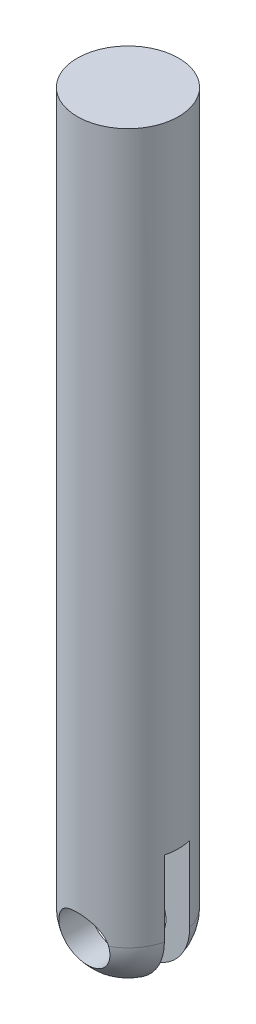
ISO-10303-21;
HEADER;
FILE_DESCRIPTION(('STEP AP214'),'2;1');
FILE_NAME('part.step','',(''),(''),'','','');
FILE_SCHEMA(('AUTOMOTIVE_DESIGN { 1 0 10303 214 1 1 1 1 }'));
ENDSEC;
DATA;
#1=APPLICATION_CONTEXT('core data for automotive mechanical design processes');
#2=APPLICATION_PROTOCOL_DEFINITION('international standard','automotive_design',2000,#1);
#3=PRODUCT_CONTEXT('',#1,'mechanical');
#4=PRODUCT('Part','Part','',(#3));
#5=PRODUCT_RELATED_PRODUCT_CATEGORY('part','',(#4));
#6=PRODUCT_DEFINITION_FORMATION('','',#4);
#7=PRODUCT_DEFINITION_CONTEXT('part definition',#1,'design');
#8=PRODUCT_DEFINITION('design','',#6,#7);
#9=PRODUCT_DEFINITION_SHAPE('','',#8);
#10=(LENGTH_UNIT() NAMED_UNIT(*) SI_UNIT(.MILLI.,.METRE.));
#11=(NAMED_UNIT(*) PLANE_ANGLE_UNIT() SI_UNIT($,.RADIAN.));
#12=(NAMED_UNIT(*) SI_UNIT($,.STERADIAN.) SOLID_ANGLE_UNIT());
#13=UNCERTAINTY_MEASURE_WITH_UNIT(LENGTH_MEASURE(1.E-05),#10,'distance_accuracy_value','');
#14=(GEOMETRIC_REPRESENTATION_CONTEXT(3) GLOBAL_UNCERTAINTY_ASSIGNED_CONTEXT((#13)) GLOBAL_UNIT_ASSIGNED_CONTEXT((#10,
#11,#12)) REPRESENTATION_CONTEXT('',''));
#15=CARTESIAN_POINT('',(0.,0.,0.));
#16=DIRECTION('',(0.,0.,1.));
#17=DIRECTION('',(1.,0.,0.));
#18=AXIS2_PLACEMENT_3D('',#15,#16,#17);
#19=CARTESIAN_POINT('',(0.,93.5,2.5));
#20=DIRECTION('',(0.,1.,0.));
#21=DIRECTION('',(1.,0.,0.));
#22=AXIS2_PLACEMENT_3D('',#19,#20,#21);
#23=SPHERICAL_SURFACE('',#22,10.);
#24=CARTESIAN_POINT('',(0.,93.5,2.5));
#25=DIRECTION('',(0.,1.,0.));
#26=DIRECTION('',(-1.,0.,0.));
#27=AXIS2_PLACEMENT_3D('',#24,#25,#26);
#28=CIRCLE('',#27,10.);
#29=CARTESIAN_POINT('',(4.89897948556635,93.5,11.2177978870813));
#30=VERTEX_POINT('',#29);
#31=CARTESIAN_POINT('',(9.68245836551854,93.5,5.));
#32=VERTEX_POINT('',#31);
#33=EDGE_CURVE('E114',#30,#32,#28,.T.);
#34=ORIENTED_EDGE('',*,*,#33,.F.);
#35=CARTESIAN_POINT('',(4.89893865648469,93.5002,11.2178208286245));
#36=CARTESIAN_POINT('',(4.92727418921963,93.3614873870076,11.2019098802133));
#37=CARTESIAN_POINT('',(4.94968515353325,93.2215887869732,11.1858184751447));
#38=CARTESIAN_POINT('',(4.98257086903547,92.9404311381345,11.1533879579725));
#39=CARTESIAN_POINT('',(4.99304624353029,92.799172160761,11.1370488588494));
#40=CARTESIAN_POINT('',(5.0019738665503,92.5163797265705,11.1042448150247));
#41=CARTESIAN_POINT('',(5.00043368842381,92.3748464988518,11.0877799561266));
#42=CARTESIAN_POINT('',(4.98536616484066,92.0924234657632,11.0548301095291));
#43=CARTESIAN_POINT('',(4.97183893845378,91.951533654016,11.0383451220313));
#44=CARTESIAN_POINT('',(4.93288594095179,91.6713588465171,11.0054681250731));
#45=CARTESIAN_POINT('',(4.90745701402313,91.5320742864509,10.9890761414407));
#46=CARTESIAN_POINT('',(4.84486426425658,91.256087182425,10.9565028063938));
#47=CARTESIAN_POINT('',(4.80769610914868,91.1193856114675,10.9403215350402));
#48=CARTESIAN_POINT('',(4.7219086944933,90.8496686132408,10.9083050231958));
#49=CARTESIAN_POINT('',(4.67329593200435,90.7166511422317,10.8924695919263));
#50=CARTESIAN_POINT('',(4.56492326752218,90.455123939594,10.8612494080196));
#51=CARTESIAN_POINT('',(4.50515926596108,90.3266158864868,10.8458648235431));
#52=CARTESIAN_POINT('',(4.37497965213287,90.0752178683008,10.8156877757602));
#53=CARTESIAN_POINT('',(4.3045755866293,89.9523219987986,10.8008946922911));
#54=CARTESIAN_POINT('',(4.1535285386618,89.7128420516729,10.7719945007179));
#55=CARTESIAN_POINT('',(4.07288177337091,89.5962603287924,10.757887648728));
#56=CARTESIAN_POINT('',(3.90195221061515,89.3703307733303,10.7304829323995));
#57=CARTESIAN_POINT('',(3.81167169322654,89.2609812389448,10.7171848778025));
#58=CARTESIAN_POINT('',(3.62205669025078,89.05024590475,10.6914990601853));
#59=CARTESIAN_POINT('',(3.52271888930685,88.9488630465753,10.6791116335154));
#60=CARTESIAN_POINT('',(3.3162831566464,88.7553812276067,10.6554216350037));
#61=CARTESIAN_POINT('',(3.2092303992527,88.6632347446997,10.6441135260503));
#62=CARTESIAN_POINT('',(2.98760357675197,88.4882463710375,10.6225986329848));
#63=CARTESIAN_POINT('',(2.8730267477674,88.405407930117,10.6123922572621));
#64=CARTESIAN_POINT('',(2.63725372669888,88.249724839181,10.5931787316651));
#65=CARTESIAN_POINT('',(2.5160606199192,88.17687558573,10.5841710294487));
#66=CARTESIAN_POINT('',(2.26782923052538,88.0416440206182,10.567425746954));
#67=CARTESIAN_POINT('',(2.14078881888704,87.979265560444,10.559688634061));
#68=CARTESIAN_POINT('',(1.88278611087447,87.8659080562942,10.5456115639289));
#69=CARTESIAN_POINT('',(1.75186082723434,87.8148462145952,10.5392614639566));
#70=CARTESIAN_POINT('',(1.48611564854605,87.7238902138853,10.5279394657527));
#71=CARTESIAN_POINT('',(1.35129434101507,87.6840001626356,10.5229680744658));
#72=CARTESIAN_POINT('',(0.942516399613429,87.5816316505213,10.5102021912795));
#73=CARTESIAN_POINT('',(0.6639590033556,87.5363290797153,10.5045403355134));
#74=CARTESIAN_POINT('',(0.10498784504106,87.4932786771967,10.4991602063714));
#75=CARTESIAN_POINT('',(-0.17540524566824,87.495251646546,10.4994070375818));
#76=CARTESIAN_POINT('',(-0.732041754387001,87.5460064676561,10.5057493957929));
#77=CARTESIAN_POINT('',(-1.00828524491241,87.5947875004583,10.5118448204661));
#78=CARTESIAN_POINT('',(-1.41305667331737,87.7017892741581,10.5251851478467));
#79=CARTESIAN_POINT('',(-1.54635769687637,87.7430841163154,10.5303301131128));
#80=CARTESIAN_POINT('',(-1.80898194746745,87.8366347892742,10.5419713905297));
#81=CARTESIAN_POINT('',(-1.93830660679206,87.8888866190365,10.5484672093975));
#82=CARTESIAN_POINT('',(-2.19211805644866,88.003995718812,10.5627564980459));
#83=CARTESIAN_POINT('',(-2.31660304688135,88.0668568889419,10.5705504450197));
#84=CARTESIAN_POINT('',(-2.55978589867423,88.2026888928239,10.587363502297));
#85=CARTESIAN_POINT('',(-2.67848582817454,88.2756560773338,10.5963821703358));
#86=CARTESIAN_POINT('',(-2.9097997684792,88.4315118110538,10.6156094270802));
#87=CARTESIAN_POINT('',(-3.02238652548756,88.5144402152202,10.6258227912078));
#88=CARTESIAN_POINT('',(-3.24012192540225,88.6893435291115,10.6473187303041));
#89=CARTESIAN_POINT('',(-3.34527322625725,88.7813151777597,10.6586009197916));
#90=CARTESIAN_POINT('',(-3.54749670634417,88.973705687764,10.6821482509802));
#91=CARTESIAN_POINT('',(-3.64456585328322,89.0741276913978,10.6944137582488));
#92=CARTESIAN_POINT('',(-3.82988426286666,89.2826354873295,10.7198194774713));
#93=CARTESIAN_POINT('',(-3.91813666956991,89.3907185240214,10.7329593748118));
#94=CARTESIAN_POINT('',(-4.08586673205085,89.6146229738032,10.7601108669664));
#95=CARTESIAN_POINT('',(-4.16527637864741,89.7304946575952,10.7741280742079));
#96=CARTESIAN_POINT('',(-4.31401014619419,89.9684016807158,10.8028313983562));
#97=CARTESIAN_POINT('',(-4.38333786544718,90.0904347999368,10.8175172741416));
#98=CARTESIAN_POINT('',(-4.51150563753912,90.3399088603274,10.8474572126065));
#99=CARTESIAN_POINT('',(-4.57033986925048,90.4673527548271,10.8627115850153));
#100=CARTESIAN_POINT('',(-4.67705487918588,90.7266401026458,10.8936594848664));
#101=CARTESIAN_POINT('',(-4.72493959993084,90.8584819527655,10.9093528519513));
#102=CARTESIAN_POINT('',(-4.80977031188505,91.1266701310123,10.9411844791957));
#103=CARTESIAN_POINT('',(-4.84663313374619,91.2630424848936,10.9573251648839));
#104=CARTESIAN_POINT('',(-4.90867764521969,91.5383416759631,10.9898143177904));
#105=CARTESIAN_POINT('',(-4.9338635602074,91.6772675701852,11.0061627076458));
#106=CARTESIAN_POINT('',(-4.97238944399948,91.9566609002362,11.0389455020962));
#107=CARTESIAN_POINT('',(-4.98573611283209,92.0971274185736,11.0553798527406));
#108=CARTESIAN_POINT('',(-5.00051338745893,92.3786389327653,11.0882214435698));
#109=CARTESIAN_POINT('',(-5.00194817252947,92.5196837083603,11.1046286912437));
#110=CARTESIAN_POINT('',(-4.99288785861755,92.8016459229522,11.1373351912218));
#111=CARTESIAN_POINT('',(-4.98237245056434,92.9425627366304,11.1536342121859));
#112=CARTESIAN_POINT('',(-4.94949463156491,93.2227767786761,11.1859551155558));
#113=CARTESIAN_POINT('',(-4.92715371833351,93.3620764787199,11.2019774465557));
#114=CARTESIAN_POINT('',(-4.89893865648469,93.5002,11.2178208286246));
#115=B_SPLINE_CURVE_WITH_KNOTS('',3,(#35,#36,#37,#38,#39,#40,#41,#42,#43,#44,#45,#46,#47,#48,
#49,#50,#51,#52,#53,#54,#55,#56,#57,#58,#59,#60,#61,#62,#63,#64,#65,#66,#67,#68,#69,#70,#71,#72,
#73,#74,#75,#76,#77,#78,#79,#80,#81,#82,#83,#84,#85,#86,#87,#88,#89,#90,#91,#92,#93,#94,#95,#96,
#97,#98,#99,#100,#101,#102,#103,#104,#105,#106,#107,#108,#109,#110,#111,#112,#113,#114),
.UNSPECIFIED.,.F.,.F.,(4,2,2,2,2,2,2,2,2,2,2,2,2,2,2,2,2,2,2,2,2,2,2,2,2,2,2,2,2,2,2,2,2,2,2,2,
2,2,2,4),(0.,0.427273695896813,0.854525077474799,1.28150718621249,1.70848505369805,
2.13557620134619,2.56282514815607,2.98983212981988,3.41699640392128,3.84370039795307,
4.27056244277984,4.69732368281735,5.12424176788651,5.54883647946182,5.97358804285703,
6.39814320033011,6.82285418194122,7.24434690288125,7.66599439982471,8.50836086019737,
9.34575372241116,10.1831319337798,10.6016659234076,11.0200473470292,11.4385829088634,
11.8569677312731,12.2770860649816,12.6970534519534,13.1171777004552,13.5371515933976,
13.9601599972521,14.3830170542763,14.8061079611405,15.2290462876217,15.6550998521153,
16.0809991254064,16.506657221096,16.932165968618,17.3583989410056,17.7838597076409),.UNSPECIFIED.);
#116=CARTESIAN_POINT('',(-4.89897948556635,93.5,11.2177978870814));
#117=VERTEX_POINT('',#116);
#118=EDGE_CURVE('E54',#30,#117,#115,.T.);
#119=ORIENTED_EDGE('',*,*,#118,.T.);
#120=CARTESIAN_POINT('',(-9.68245836551856,93.5,5.));
#121=VERTEX_POINT('',#120);
#122=EDGE_CURVE('E113',#121,#117,#28,.T.);
#123=ORIENTED_EDGE('',*,*,#122,.F.);
#124=CARTESIAN_POINT('',(0.,93.5,5.));
#125=DIRECTION('',(0.,0.,1.));
#126=DIRECTION('',(0.,-1.,0.));
#127=AXIS2_PLACEMENT_3D('',#124,#125,#126);
#128=CIRCLE('',#127,9.68245836551855);
#129=EDGE_CURVE('E128',#121,#32,#128,.T.);
#130=ORIENTED_EDGE('',*,*,#129,.T.);
#131=EDGE_LOOP('',(#34,#119,#123,#130));
#132=FACE_BOUND('',#131,.T.);
#133=ADVANCED_FACE('F39',(#132),#23,.T.);
#134=CARTESIAN_POINT('',(0.,233.5,2.5));
#135=DIRECTION('',(0.,-1.,0.));
#136=DIRECTION('',(1.,0.,0.));
#137=AXIS2_PLACEMENT_3D('',#134,#135,#136);
#138=PLANE('',#137);
#139=CARTESIAN_POINT('',(0.,233.5,2.5));
#140=DIRECTION('',(0.,1.,0.));
#141=DIRECTION('',(-1.,0.,0.));
#142=AXIS2_PLACEMENT_3D('',#139,#140,#141);
#143=CIRCLE('',#142,10.);
#144=CARTESIAN_POINT('',(-9.99999999999999,233.5,2.5));
#145=VERTEX_POINT('',#144);
#146=EDGE_CURVE('E119',#145,#145,#143,.T.);
#147=ORIENTED_EDGE('',*,*,#146,.T.);
#148=EDGE_LOOP('',(#147));
#149=FACE_BOUND('',#148,.T.);
#150=ADVANCED_FACE('F41',(#149),#138,.F.);
#151=CARTESIAN_POINT('',(0.,233.5,2.5));
#152=DIRECTION('',(0.,1.,0.));
#153=DIRECTION('',(-1.,0.,0.));
#154=AXIS2_PLACEMENT_3D('',#151,#152,#153);
#155=CYLINDRICAL_SURFACE('',#154,10.);
#156=ORIENTED_EDGE('',*,*,#146,.F.);
#157=EDGE_LOOP('',(#156));
#158=FACE_BOUND('',#157,.T.);
#159=ORIENTED_EDGE('',*,*,#122,.T.);
#160=CARTESIAN_POINT('',(-4.89897948556635,93.5,11.2177978870814));
#161=CARTESIAN_POINT('',(-4.87104349833318,93.6369384855685,11.233478375009));
#162=CARTESIAN_POINT('',(-4.83741488474298,93.7723099813617,11.2522179650321));
#163=CARTESIAN_POINT('',(-4.75930365987262,94.0389163103772,11.294946850961));
#164=CARTESIAN_POINT('',(-4.71483008370714,94.1701544848942,11.3189317751864));
#165=CARTESIAN_POINT('',(-4.61570987501826,94.4272090332767,11.3712074102433));
#166=CARTESIAN_POINT('',(-4.56110445618861,94.5530449155461,11.3994805953781));
#167=CARTESIAN_POINT('',(-4.44213756616435,94.7991537347802,11.4594564697463));
#168=CARTESIAN_POINT('',(-4.37777409514467,94.9194255248247,11.4911598615877));
#169=CARTESIAN_POINT('',(-4.17123049744626,95.2702483854698,11.5897764896488));
#170=CARTESIAN_POINT('',(-4.01521589862719,95.4917850876563,11.6604075821168));
#171=CARTESIAN_POINT('',(-3.66982029663845,95.90666932499,11.8041589851695));
#172=CARTESIAN_POINT('',(-3.48039309764252,96.0999771459841,11.8772826275132));
#173=CARTESIAN_POINT('',(-3.1668573317209,96.371952846699,11.9860152543039));
#174=CARTESIAN_POINT('',(-3.05319684918641,96.4622110724451,12.0232952243291));
#175=CARTESIAN_POINT('',(-2.81798349877699,96.6328022897707,12.0955238119123));
#176=CARTESIAN_POINT('',(-2.69643360210925,96.7131389851578,12.1304732972087));
#177=CARTESIAN_POINT('',(-2.44611729460878,96.8632338074191,12.1970762184314));
#178=CARTESIAN_POINT('',(-2.31735114221229,96.9329923127995,12.2287297722794));
#179=CARTESIAN_POINT('',(-2.05346425440719,97.0612265404892,12.2878266038412));
#180=CARTESIAN_POINT('',(-1.91834692859288,97.1197082325667,12.3152721076456));
#181=CARTESIAN_POINT('',(-1.64834218796651,97.2226022756219,12.3641273235605));
#182=CARTESIAN_POINT('',(-1.51367453360394,97.2674949118097,12.3857390813795));
#183=CARTESIAN_POINT('',(-1.24038064451454,97.3457865302565,12.4237328975984));
#184=CARTESIAN_POINT('',(-1.10175638416906,97.3791911401861,12.4401175163456));
#185=CARTESIAN_POINT('',(-0.821669991821929,97.4340871595084,12.4671784080935));
#186=CARTESIAN_POINT('',(-0.680208939144742,97.4555830139871,12.477856810955));
#187=CARTESIAN_POINT('',(-0.395645237857533,97.4863754344659,12.4931856703762));
#188=CARTESIAN_POINT('',(-0.252542739820538,97.4956731105428,12.4978366754498));
#189=CARTESIAN_POINT('',(0.0198623327122231,97.501629428405,12.5008147075909));
#190=CARTESIAN_POINT('',(0.149134996902007,97.4994433970262,12.4997198166663));
#191=CARTESIAN_POINT('',(0.407029112407416,97.485078698897,12.4925457248736));
#192=CARTESIAN_POINT('',(0.53565034038626,97.4728968114429,12.4864649175242));
#193=CARTESIAN_POINT('',(0.791193089472857,97.4386866400429,12.4694737103009));
#194=CARTESIAN_POINT('',(0.918115312043412,97.4166625573939,12.4585653711544));
#195=CARTESIAN_POINT('',(1.16947473087862,97.3630085933616,12.4321854396539));
#196=CARTESIAN_POINT('',(1.29391095727814,97.3313750381117,12.4167121020878));
#197=CARTESIAN_POINT('',(1.53753539714847,97.2593973812568,12.3818463148536));
#198=CARTESIAN_POINT('',(1.65677509365263,97.2191961350442,12.3625184387188));
#199=CARTESIAN_POINT('',(1.89134748177165,97.1301795768773,12.3202360994228));
#200=CARTESIAN_POINT('',(2.0066787936292,97.0813612598762,12.2972803714074));
#201=CARTESIAN_POINT('',(2.34581151922415,96.9225992827286,12.223709476578));
#202=CARTESIAN_POINT('',(2.56294019078022,96.8002923162603,12.1683624610283));
#203=CARTESIAN_POINT('',(2.99198662061079,96.5149474307137,12.0447349812844));
#204=CARTESIAN_POINT('',(3.20201952118904,96.3493931870709,11.9757663556231));
#205=CARTESIAN_POINT('',(3.59278517505727,95.9875427810784,11.8346198515953));
#206=CARTESIAN_POINT('',(3.77348259834384,95.7912101018571,11.7624382349858));
#207=CARTESIAN_POINT('',(4.11617962811637,95.3531962199911,11.6156320605665));
#208=CARTESIAN_POINT('',(4.27523725244417,95.1090676955732,11.5413307706622));
#209=CARTESIAN_POINT('',(4.48085164409501,94.7233339511661,11.4402354482765));
#210=CARTESIAN_POINT('',(4.54386186974605,94.591598139032,11.4082818422301));
#211=CARTESIAN_POINT('',(4.65840023005525,94.3222710852403,11.3489243641956));
#212=CARTESIAN_POINT('',(4.70993625679031,94.1846839462483,11.3215173683282));
#213=CARTESIAN_POINT('',(4.78433735318512,93.9556397368281,11.281298303135));
#214=CARTESIAN_POINT('',(4.81080902394751,93.8656290629946,11.2668057909693));
#215=CARTESIAN_POINT('',(4.85870427077353,93.6839812295806,11.2403502507724));
#216=CARTESIAN_POINT('',(4.88013147156932,93.5923452890728,11.2283854071093));
#217=CARTESIAN_POINT('',(4.89897948556635,93.5,11.2177978870813));
#218=B_SPLINE_CURVE_WITH_KNOTS('',3,(#160,#161,#162,#163,#164,#165,#166,#167,#168,#169,#170,
#171,#172,#173,#174,#175,#176,#177,#178,#179,#180,#181,#182,#183,#184,#185,#186,#187,#188,#189,
#190,#191,#192,#193,#194,#195,#196,#197,#198,#199,#200,#201,#202,#203,#204,#205,#206,#207,#208,
#209,#210,#211,#212,#213,#214,#215,#216,#217),.UNSPECIFIED.,.F.,.F.,(4,2,2,2,2,2,2,2,2,2,2,2,2,
2,2,2,2,2,2,2,2,2,2,2,2,2,2,2,4),(0.,0.421672305953377,0.842994502922417,1.26263901908108,
1.68236965415838,2.51865705181693,3.35610988446723,3.80518928425794,4.25410052813424,
4.70299570538355,5.151652588191,5.58182977746259,6.01179593349062,6.44160149116709,
6.87136793232118,7.258778902637,7.64631474731075,8.03368532395691,8.42120418582105,
8.8027068308287,9.18434278175017,9.94702519497318,10.7722025163055,11.5983663784935,
12.4955393601446,12.9434998164928,13.3911512024052,13.6757912642916,13.9602261679081),.UNSPECIFIED.);
#219=EDGE_CURVE('E101',#117,#30,#218,.T.);
#220=ORIENTED_EDGE('',*,*,#219,.T.);
#221=ORIENTED_EDGE('',*,*,#33,.T.);
#222=DIRECTION('',(0.,1.,0.));
#223=VECTOR('',#222,1.);
#224=CARTESIAN_POINT('',(9.68245836551855,233.5,5.00000000000002));
#225=LINE('',#224,#223);
#226=CARTESIAN_POINT('',(9.68245836551854,108.400596071662,5.));
#227=VERTEX_POINT('',#226);
#228=EDGE_CURVE('E111',#32,#227,#225,.T.);
#229=ORIENTED_EDGE('',*,*,#228,.T.);
#230=CARTESIAN_POINT('',(0.,108.400596071662,2.5));
#231=DIRECTION('',(0.,1.,0.));
#232=DIRECTION('',(0.,0.,1.));
#233=AXIS2_PLACEMENT_3D('',#230,#231,#232);
#234=CIRCLE('',#233,10.);
#235=CARTESIAN_POINT('',(9.68245836551853,108.400596071662,0.));
#236=VERTEX_POINT('',#235);
#237=EDGE_CURVE('E48',#227,#236,#234,.T.);
#238=ORIENTED_EDGE('',*,*,#237,.T.);
#239=DIRECTION('',(0.,1.,0.));
#240=VECTOR('',#239,1.);
#241=CARTESIAN_POINT('',(9.68245836551855,233.5,0.));
#242=LINE('',#241,#240);
#243=CARTESIAN_POINT('',(9.68245836551854,93.5,0.));
#244=VERTEX_POINT('',#243);
#245=EDGE_CURVE('E200',#236,#244,#242,.F.);
#246=ORIENTED_EDGE('',*,*,#245,.T.);
#247=CARTESIAN_POINT('',(4.89897948556635,93.5,-6.21779788708135));
#248=VERTEX_POINT('',#247);
#249=EDGE_CURVE('E100',#244,#248,#28,.T.);
#250=ORIENTED_EDGE('',*,*,#249,.T.);
#251=CARTESIAN_POINT('',(4.89897948556635,93.5,-6.21779788708134));
#252=CARTESIAN_POINT('',(4.87104349833318,93.6369384855685,-6.233478375009));
#253=CARTESIAN_POINT('',(4.83741488474298,93.7723099813617,-6.25221796503205));
#254=CARTESIAN_POINT('',(4.75930365987262,94.0389163103772,-6.29494685096101));
#255=CARTESIAN_POINT('',(4.71483008370714,94.1701544848942,-6.31893177518635));
#256=CARTESIAN_POINT('',(4.61570987501826,94.4272090332767,-6.37120741024334));
#257=CARTESIAN_POINT('',(4.56110445618861,94.5530449155461,-6.39948059537804));
#258=CARTESIAN_POINT('',(4.44213756616435,94.7991537347802,-6.45945646974632));
#259=CARTESIAN_POINT('',(4.37777409514467,94.9194255248247,-6.49115986158769));
#260=CARTESIAN_POINT('',(4.17123049744626,95.2702483854698,-6.58977648964884));
#261=CARTESIAN_POINT('',(4.01521589862719,95.4917850876563,-6.66040758211675));
#262=CARTESIAN_POINT('',(3.66982029663845,95.90666932499,-6.80415898516953));
#263=CARTESIAN_POINT('',(3.48039309764252,96.0999771459841,-6.87728262751317));
#264=CARTESIAN_POINT('',(3.1668573317209,96.371952846699,-6.9860152543039));
#265=CARTESIAN_POINT('',(3.05319684918641,96.4622110724451,-7.02329522432906));
#266=CARTESIAN_POINT('',(2.817983498777,96.6328022897707,-7.09552381191233));
#267=CARTESIAN_POINT('',(2.69643360210925,96.7131389851578,-7.13047329720867));
#268=CARTESIAN_POINT('',(2.44611729460878,96.8632338074191,-7.19707621843141));
#269=CARTESIAN_POINT('',(2.31735114221229,96.9329923127995,-7.22872977227934));
#270=CARTESIAN_POINT('',(2.05346425440718,97.0612265404892,-7.28782660384117));
#271=CARTESIAN_POINT('',(1.91834692859288,97.1197082325667,-7.31527210764558));
#272=CARTESIAN_POINT('',(1.64834218796651,97.2226022756219,-7.3641273235605));
#273=CARTESIAN_POINT('',(1.51367453360394,97.2674949118096,-7.38573908137951));
#274=CARTESIAN_POINT('',(1.24038064451455,97.3457865302565,-7.42373289759839));
#275=CARTESIAN_POINT('',(1.10175638416906,97.3791911401861,-7.4401175163456));
#276=CARTESIAN_POINT('',(0.821669991821929,97.4340871595084,-7.4671784080935));
#277=CARTESIAN_POINT('',(0.680208939144741,97.4555830139871,-7.477856810955));
#278=CARTESIAN_POINT('',(0.395645237857532,97.4863754344659,-7.49318567037625));
#279=CARTESIAN_POINT('',(0.252542739820537,97.4956731105428,-7.4978366754498));
#280=CARTESIAN_POINT('',(-0.0198623327122239,97.501629428405,-7.50081470759086));
#281=CARTESIAN_POINT('',(-0.149134996902008,97.4994433970262,-7.4997198166663));
#282=CARTESIAN_POINT('',(-0.407029112407417,97.485078698897,-7.49254572487357));
#283=CARTESIAN_POINT('',(-0.535650340386261,97.4728968114429,-7.48646491752423));
#284=CARTESIAN_POINT('',(-0.791193089472856,97.4386866400429,-7.46947371030086));
#285=CARTESIAN_POINT('',(-0.91811531204341,97.4166625573939,-7.45856537115443));
#286=CARTESIAN_POINT('',(-1.16947473087862,97.3630085933616,-7.43218543965391));
#287=CARTESIAN_POINT('',(-1.29391095727814,97.3313750381117,-7.41671210208776));
#288=CARTESIAN_POINT('',(-1.53753539714847,97.2593973812568,-7.38184631485359));
#289=CARTESIAN_POINT('',(-1.65677509365263,97.2191961350442,-7.36251843871884));
#290=CARTESIAN_POINT('',(-1.89134748177165,97.1301795768773,-7.32023609942282));
#291=CARTESIAN_POINT('',(-2.0066787936292,97.0813612598762,-7.29728037140741));
#292=CARTESIAN_POINT('',(-2.34581151922415,96.9225992827286,-7.22370947657796));
#293=CARTESIAN_POINT('',(-2.56294019078023,96.8002923162603,-7.16836246102831));
#294=CARTESIAN_POINT('',(-2.99198662061079,96.5149474307137,-7.04473498128436));
#295=CARTESIAN_POINT('',(-3.20201952118904,96.3493931870709,-6.9757663556231));
#296=CARTESIAN_POINT('',(-3.59278517505727,95.9875427810784,-6.83461985159527));
#297=CARTESIAN_POINT('',(-3.77348259834384,95.7912101018571,-6.76243823498584));
#298=CARTESIAN_POINT('',(-4.11617962811637,95.3531962199911,-6.61563206056646));
#299=CARTESIAN_POINT('',(-4.27523725244417,95.1090676955732,-6.54133077066218));
#300=CARTESIAN_POINT('',(-4.48085164409501,94.7233339511661,-6.44023544827651));
#301=CARTESIAN_POINT('',(-4.54386186974605,94.591598139032,-6.40828184223013));
#302=CARTESIAN_POINT('',(-4.65840023005525,94.3222710852403,-6.34892436419565));
#303=CARTESIAN_POINT('',(-4.70993625679031,94.1846839462483,-6.32151736832826));
#304=CARTESIAN_POINT('',(-4.78433735318512,93.9556397368281,-6.28129830313504));
#305=CARTESIAN_POINT('',(-4.81080902394751,93.8656290629946,-6.26680579096934));
#306=CARTESIAN_POINT('',(-4.85870427077353,93.6839812295806,-6.24035025077242));
#307=CARTESIAN_POINT('',(-4.88013147156932,93.5923452890728,-6.22838540710932));
#308=CARTESIAN_POINT('',(-4.89897948556635,93.5,-6.21779788708136));
#309=B_SPLINE_CURVE_WITH_KNOTS('',3,(#251,#252,#253,#254,#255,#256,#257,#258,#259,#260,#261,
#262,#263,#264,#265,#266,#267,#268,#269,#270,#271,#272,#273,#274,#275,#276,#277,#278,#279,#280,
#281,#282,#283,#284,#285,#286,#287,#288,#289,#290,#291,#292,#293,#294,#295,#296,#297,#298,#299,
#300,#301,#302,#303,#304,#305,#306,#307,#308),.UNSPECIFIED.,.F.,.F.,(4,2,2,2,2,2,2,2,2,2,2,2,2,
2,2,2,2,2,2,2,2,2,2,2,2,2,2,2,4),(0.,0.421672305953377,0.842994502922418,1.26263901908107,
1.68236965415838,2.51865705181694,3.35610988446723,3.80518928425794,4.25410052813424,
4.70299570538356,5.151652588191,5.58182977746258,6.01179593349062,6.44160149116709,
6.87136793232118,7.258778902637,7.64631474731075,8.0336853239569,8.42120418582105,
8.8027068308287,9.18434278175017,9.94702519497318,10.7722025163055,11.5983663784935,
12.4955393601446,12.9434998164928,13.3911512024052,13.6757912642916,13.9602261679081),.UNSPECIFIED.);
#310=CARTESIAN_POINT('',(-4.89897948556635,93.5,-6.21779788708136));
#311=VERTEX_POINT('',#310);
#312=EDGE_CURVE('E61',#248,#311,#309,.T.);
#313=ORIENTED_EDGE('',*,*,#312,.T.);
#314=CARTESIAN_POINT('',(-9.68245836551856,93.5,0.));
#315=VERTEX_POINT('',#314);
#316=EDGE_CURVE('E96',#311,#315,#28,.T.);
#317=ORIENTED_EDGE('',*,*,#316,.T.);
#318=DIRECTION('',(0.,1.,0.));
#319=VECTOR('',#318,1.);
#320=CARTESIAN_POINT('',(-9.68245836551854,233.5,0.));
#321=LINE('',#320,#319);
#322=CARTESIAN_POINT('',(-9.68245836551855,108.400596071662,0.));
#323=VERTEX_POINT('',#322);
#324=EDGE_CURVE('E202',#315,#323,#321,.T.);
#325=ORIENTED_EDGE('',*,*,#324,.T.);
#326=CARTESIAN_POINT('',(-9.68245836551855,108.400596071662,5.));
#327=VERTEX_POINT('',#326);
#328=EDGE_CURVE('E11',#323,#327,#234,.T.);
#329=ORIENTED_EDGE('',*,*,#328,.T.);
#330=DIRECTION('',(0.,1.,0.));
#331=VECTOR('',#330,1.);
#332=CARTESIAN_POINT('',(-9.68245836551853,233.5,5.00000000000002));
#333=LINE('',#332,#331);
#334=EDGE_CURVE('E116',#327,#121,#333,.F.);
#335=ORIENTED_EDGE('',*,*,#334,.T.);
#336=EDGE_LOOP('',(#159,#220,#221,#229,#238,#246,#250,#313,#317,#325,#329,#335));
#337=FACE_BOUND('',#336,.T.);
#338=ADVANCED_FACE('F93',(#158,#337),#155,.T.);
#339=ORIENTED_EDGE('',*,*,#316,.F.);
#340=CARTESIAN_POINT('',(-4.89893865648469,93.5002,-6.21782082862456));
#341=CARTESIAN_POINT('',(-4.92727418921963,93.3614873870076,-6.20190988021332));
#342=CARTESIAN_POINT('',(-4.94968515353325,93.2215887869732,-6.18581847514466));
#343=CARTESIAN_POINT('',(-4.98257086903547,92.9404311381345,-6.15338795797251));
#344=CARTESIAN_POINT('',(-4.99304624353029,92.799172160761,-6.13704885884937));
#345=CARTESIAN_POINT('',(-5.0019738665503,92.5163797265705,-6.10424481502466));
#346=CARTESIAN_POINT('',(-5.00043368842381,92.3748464988518,-6.08777995612661));
#347=CARTESIAN_POINT('',(-4.98536616484066,92.0924234657632,-6.05483010952916));
#348=CARTESIAN_POINT('',(-4.97183893845378,91.951533654016,-6.03834512203133));
#349=CARTESIAN_POINT('',(-4.93288594095179,91.6713588465171,-6.00546812507309));
#350=CARTESIAN_POINT('',(-4.90745701402313,91.5320742864509,-5.98907614144073));
#351=CARTESIAN_POINT('',(-4.84486426425658,91.256087182425,-5.95650280639385));
#352=CARTESIAN_POINT('',(-4.80769610914868,91.1193856114675,-5.94032153504018));
#353=CARTESIAN_POINT('',(-4.7219086944933,90.8496686132408,-5.90830502319584));
#354=CARTESIAN_POINT('',(-4.67329593200435,90.7166511422317,-5.89246959192635));
#355=CARTESIAN_POINT('',(-4.56492326752218,90.455123939594,-5.86124940801957));
#356=CARTESIAN_POINT('',(-4.50515926596108,90.3266158864868,-5.8458648235431));
#357=CARTESIAN_POINT('',(-4.37497965213287,90.0752178683008,-5.81568777576026));
#358=CARTESIAN_POINT('',(-4.30457558662928,89.9523219987986,-5.80089469229109));
#359=CARTESIAN_POINT('',(-4.15352853866178,89.7128420516729,-5.77199450071786));
#360=CARTESIAN_POINT('',(-4.0728817733709,89.5962603287923,-5.75788764872803));
#361=CARTESIAN_POINT('',(-3.90195221061514,89.3703307733303,-5.73048293239947));
#362=CARTESIAN_POINT('',(-3.81167169322653,89.2609812389448,-5.71718487780253));
#363=CARTESIAN_POINT('',(-3.62205669025077,89.05024590475,-5.69149906018535));
#364=CARTESIAN_POINT('',(-3.52271888930684,88.9488630465753,-5.67911163351542));
#365=CARTESIAN_POINT('',(-3.31628315664639,88.7553812276067,-5.65542163500371));
#366=CARTESIAN_POINT('',(-3.20923039925269,88.6632347446997,-5.64411352605036));
#367=CARTESIAN_POINT('',(-2.98760357675197,88.4882463710375,-5.6225986329848));
#368=CARTESIAN_POINT('',(-2.87302674776739,88.405407930117,-5.61239225726212));
#369=CARTESIAN_POINT('',(-2.63725372669888,88.249724839181,-5.59317873166508));
#370=CARTESIAN_POINT('',(-2.5160606199192,88.17687558573,-5.58417102944869));
#371=CARTESIAN_POINT('',(-2.26782923052538,88.0416440206182,-5.56742574695401));
#372=CARTESIAN_POINT('',(-2.14078881888704,87.979265560444,-5.55968863406098));
#373=CARTESIAN_POINT('',(-1.88278611087447,87.8659080562942,-5.54561156392891));
#374=CARTESIAN_POINT('',(-1.75186082723434,87.8148462145952,-5.53926146395657));
#375=CARTESIAN_POINT('',(-1.48611564854605,87.7238902138853,-5.52793946575273));
#376=CARTESIAN_POINT('',(-1.35129434101507,87.6840001626356,-5.52296807446585));
#377=CARTESIAN_POINT('',(-0.942516399613429,87.5816316505213,-5.51020219127945));
#378=CARTESIAN_POINT('',(-0.6639590033556,87.5363290797153,-5.50454033551344));
#379=CARTESIAN_POINT('',(-0.104987845041059,87.4932786771967,-5.49916020637143));
#380=CARTESIAN_POINT('',(0.17540524566824,87.495251646546,-5.49940703758177));
#381=CARTESIAN_POINT('',(0.732041754387,87.5460064676561,-5.50574939579288));
#382=CARTESIAN_POINT('',(1.00828524491241,87.5947875004583,-5.51184482046606));
#383=CARTESIAN_POINT('',(1.41305667331737,87.7017892741581,-5.52518514784674));
#384=CARTESIAN_POINT('',(1.54635769687637,87.7430841163154,-5.53033011311284));
#385=CARTESIAN_POINT('',(1.80898194746745,87.8366347892742,-5.54197139052974));
#386=CARTESIAN_POINT('',(1.93830660679206,87.8888866190365,-5.54846720939748));
#387=CARTESIAN_POINT('',(2.19211805644866,88.003995718812,-5.56275649804591));
#388=CARTESIAN_POINT('',(2.31660304688135,88.0668568889419,-5.57055044501966));
#389=CARTESIAN_POINT('',(2.55978589867423,88.2026888928239,-5.58736350229702));
#390=CARTESIAN_POINT('',(2.67848582817454,88.2756560773338,-5.59638217033582));
#391=CARTESIAN_POINT('',(2.9097997684792,88.4315118110538,-5.61560942708021));
#392=CARTESIAN_POINT('',(3.02238652548756,88.5144402152202,-5.62582279120775));
#393=CARTESIAN_POINT('',(3.24012192540225,88.6893435291115,-5.64731873030414));
#394=CARTESIAN_POINT('',(3.34527322625725,88.7813151777597,-5.65860091979158));
#395=CARTESIAN_POINT('',(3.54749670634417,88.973705687764,-5.68214825098024));
#396=CARTESIAN_POINT('',(3.64456585328322,89.0741276913978,-5.69441375824883));
#397=CARTESIAN_POINT('',(3.82988426286666,89.2826354873295,-5.71981947747132));
#398=CARTESIAN_POINT('',(3.91813666956991,89.3907185240214,-5.73295937481182));
#399=CARTESIAN_POINT('',(4.08586673205085,89.6146229738032,-5.76011086696643));
#400=CARTESIAN_POINT('',(4.16527637864741,89.7304946575952,-5.77412807420788));
#401=CARTESIAN_POINT('',(4.31401014619419,89.9684016807158,-5.80283139835615));
#402=CARTESIAN_POINT('',(4.38333786544718,90.0904347999368,-5.81751727414155));
#403=CARTESIAN_POINT('',(4.51150563753912,90.3399088603274,-5.8474572126065));
#404=CARTESIAN_POINT('',(4.57033986925048,90.4673527548271,-5.86271158501524));
#405=CARTESIAN_POINT('',(4.67705487918588,90.7266401026458,-5.89365948486643));
#406=CARTESIAN_POINT('',(4.72493959993084,90.8584819527655,-5.90935285195132));
#407=CARTESIAN_POINT('',(4.80977031188504,91.1266701310123,-5.94118447919564));
#408=CARTESIAN_POINT('',(4.84663313374619,91.2630424848936,-5.95732516488393));
#409=CARTESIAN_POINT('',(4.90867764521969,91.5383416759631,-5.98981431779043));
#410=CARTESIAN_POINT('',(4.93386356020739,91.6772675701852,-6.00616270764579));
#411=CARTESIAN_POINT('',(4.97238944399948,91.9566609002362,-6.03894550209624));
#412=CARTESIAN_POINT('',(4.98573611283209,92.0971274185736,-6.05537985274058));
#413=CARTESIAN_POINT('',(5.00051338745893,92.3786389327653,-6.08822144356982));
#414=CARTESIAN_POINT('',(5.00194817252947,92.5196837083603,-6.10462869124365));
#415=CARTESIAN_POINT('',(4.99288785861755,92.8016459229522,-6.13733519122176));
#416=CARTESIAN_POINT('',(4.98237245056434,92.9425627366304,-6.15363421218588));
#417=CARTESIAN_POINT('',(4.94949463156491,93.2227767786761,-6.18595511555578));
#418=CARTESIAN_POINT('',(4.92715371833351,93.3620764787199,-6.20197744655565));
#419=CARTESIAN_POINT('',(4.89893865648469,93.5002,-6.21782082862455));
#420=B_SPLINE_CURVE_WITH_KNOTS('',3,(#340,#341,#342,#343,#344,#345,#346,#347,#348,#349,#350,
#351,#352,#353,#354,#355,#356,#357,#358,#359,#360,#361,#362,#363,#364,#365,#366,#367,#368,#369,
#370,#371,#372,#373,#374,#375,#376,#377,#378,#379,#380,#381,#382,#383,#384,#385,#386,#387,#388,
#389,#390,#391,#392,#393,#394,#395,#396,#397,#398,#399,#400,#401,#402,#403,#404,#405,#406,#407,
#408,#409,#410,#411,#412,#413,#414,#415,#416,#417,#418,#419),.UNSPECIFIED.,.F.,.F.,(4,2,2,2,2,2,
2,2,2,2,2,2,2,2,2,2,2,2,2,2,2,2,2,2,2,2,2,2,2,2,2,2,2,2,2,2,2,2,2,4),(0.,0.427273695896812,
0.854525077474799,1.28150718621249,1.70848505369805,2.13557620134619,2.56282514815606,
2.98983212981988,3.41699640392129,3.8437003979531,4.27056244277985,4.69732368281736,
5.12424176788651,5.54883647946183,5.97358804285703,6.39814320033011,6.82285418194122,
7.24434690288125,7.66599439982471,8.50836086019737,9.34575372241116,10.1831319337798,
10.6016659234076,11.0200473470292,11.4385829088634,11.8569677312731,12.2770860649816,
12.6970534519533,13.1171777004552,13.5371515933976,13.9601599972521,14.3830170542763,
14.8061079611405,15.2290462876217,15.6550998521153,16.0809991254064,16.506657221096,
16.932165968618,17.3583989410056,17.7838597076409),.UNSPECIFIED.);
#421=EDGE_CURVE('E102',#311,#248,#420,.T.);
#422=ORIENTED_EDGE('',*,*,#421,.T.);
#423=ORIENTED_EDGE('',*,*,#249,.F.);
#424=CARTESIAN_POINT('',(0.,93.5,0.));
#425=DIRECTION('',(0.,0.,-1.));
#426=DIRECTION('',(-1.,0.,0.));
#427=AXIS2_PLACEMENT_3D('',#424,#425,#426);
#428=CIRCLE('',#427,9.68245836551855);
#429=EDGE_CURVE('E110',#244,#315,#428,.T.);
#430=ORIENTED_EDGE('',*,*,#429,.T.);
#431=EDGE_LOOP('',(#339,#422,#423,#430));
#432=FACE_BOUND('',#431,.T.);
#433=ADVANCED_FACE('F109',(#432),#23,.T.);
#434=CARTESIAN_POINT('',(-10.,108.400596071662,5.));
#435=DIRECTION('',(0.,1.,0.));
#436=DIRECTION('',(0.,0.,1.));
#437=AXIS2_PLACEMENT_3D('',#434,#435,#436);
#438=PLANE('',#437);
#439=DIRECTION('',(1.,0.,0.));
#440=VECTOR('',#439,1.);
#441=CARTESIAN_POINT('',(-10.,108.400596071662,5.));
#442=LINE('',#441,#440);
#443=EDGE_CURVE('E131',#327,#227,#442,.T.);
#444=ORIENTED_EDGE('',*,*,#443,.F.);
#445=ORIENTED_EDGE('',*,*,#328,.F.);
#446=DIRECTION('',(1.,0.,0.));
#447=VECTOR('',#446,1.);
#448=CARTESIAN_POINT('',(-10.,108.400596071662,0.));
#449=LINE('',#448,#447);
#450=EDGE_CURVE('E168',#323,#236,#449,.T.);
#451=ORIENTED_EDGE('',*,*,#450,.T.);
#452=ORIENTED_EDGE('',*,*,#237,.F.);
#453=EDGE_LOOP('',(#444,#445,#451,#452));
#454=FACE_BOUND('',#453,.T.);
#455=ADVANCED_FACE('F144',(#454),#438,.F.);
#456=CARTESIAN_POINT('',(-10.,108.400596071662,5.));
#457=DIRECTION('',(0.,0.,1.));
#458=DIRECTION('',(0.,-1.,0.));
#459=AXIS2_PLACEMENT_3D('',#456,#457,#458);
#460=PLANE('',#459);
#461=CARTESIAN_POINT('',(0.,92.5,5.));
#462=DIRECTION('',(0.,0.,1.));
#463=DIRECTION('',(0.,-1.,0.));
#464=AXIS2_PLACEMENT_3D('',#461,#462,#463);
#465=CIRCLE('',#464,5.);
#466=CARTESIAN_POINT('',(0.,87.5,5.));
#467=VERTEX_POINT('',#466);
#468=EDGE_CURVE('E106',#467,#467,#465,.T.);
#469=ORIENTED_EDGE('',*,*,#468,.T.);
#470=EDGE_LOOP('',(#469));
#471=FACE_BOUND('',#470,.T.);
#472=ORIENTED_EDGE('',*,*,#129,.F.);
#473=ORIENTED_EDGE('',*,*,#334,.F.);
#474=ORIENTED_EDGE('',*,*,#443,.T.);
#475=ORIENTED_EDGE('',*,*,#228,.F.);
#476=EDGE_LOOP('',(#472,#473,#474,#475));
#477=FACE_BOUND('',#476,.T.);
#478=ADVANCED_FACE('F127',(#471,#477),#460,.F.);
#479=CARTESIAN_POINT('',(-10.,108.400596071662,0.));
#480=DIRECTION('',(0.,0.,-1.));
#481=DIRECTION('',(-1.,0.,0.));
#482=AXIS2_PLACEMENT_3D('',#479,#480,#481);
#483=PLANE('',#482);
#484=CARTESIAN_POINT('',(0.,92.5,0.));
#485=DIRECTION('',(0.,0.,-1.));
#486=DIRECTION('',(-1.,0.,0.));
#487=AXIS2_PLACEMENT_3D('',#484,#485,#486);
#488=CIRCLE('',#487,5.);
#489=CARTESIAN_POINT('',(-5.,92.5,0.));
#490=VERTEX_POINT('',#489);
#491=EDGE_CURVE('E43',#490,#490,#488,.T.);
#492=ORIENTED_EDGE('',*,*,#491,.T.);
#493=EDGE_LOOP('',(#492));
#494=FACE_BOUND('',#493,.T.);
#495=ORIENTED_EDGE('',*,*,#429,.F.);
#496=ORIENTED_EDGE('',*,*,#245,.F.);
#497=ORIENTED_EDGE('',*,*,#450,.F.);
#498=ORIENTED_EDGE('',*,*,#324,.F.);
#499=EDGE_LOOP('',(#495,#496,#497,#498));
#500=FACE_BOUND('',#499,.T.);
#501=ADVANCED_FACE('F187',(#494,#500),#483,.F.);
#502=CARTESIAN_POINT('',(0.,92.5,-7.5));
#503=DIRECTION('',(0.,0.,1.));
#504=DIRECTION('',(1.,0.,0.));
#505=AXIS2_PLACEMENT_3D('',#502,#503,#504);
#506=CYLINDRICAL_SURFACE('',#505,5.);
#507=ORIENTED_EDGE('',*,*,#491,.F.);
#508=EDGE_LOOP('',(#507));
#509=FACE_BOUND('',#508,.T.);
#510=ORIENTED_EDGE('',*,*,#421,.F.);
#511=ORIENTED_EDGE('',*,*,#312,.F.);
#512=EDGE_LOOP('',(#510,#511));
#513=FACE_BOUND('',#512,.T.);
#514=ADVANCED_FACE('F104',(#509,#513),#506,.F.);
#515=ORIENTED_EDGE('',*,*,#468,.F.);
#516=EDGE_LOOP('',(#515));
#517=FACE_BOUND('',#516,.T.);
#518=ORIENTED_EDGE('',*,*,#219,.F.);
#519=ORIENTED_EDGE('',*,*,#118,.F.);
#520=EDGE_LOOP('',(#518,#519));
#521=FACE_BOUND('',#520,.T.);
#522=ADVANCED_FACE('F174',(#517,#521),#506,.F.);
#523=CLOSED_SHELL('',(#133,#150,#338,#433,#455,#478,#501,#514,#522));
#524=MANIFOLD_SOLID_BREP('B2',#523);
#525=ADVANCED_BREP_SHAPE_REPRESENTATION('',(#18,#524),#14);
#526=SHAPE_DEFINITION_REPRESENTATION(#9,#525);
ENDSEC;
END-ISO-10303-21;
